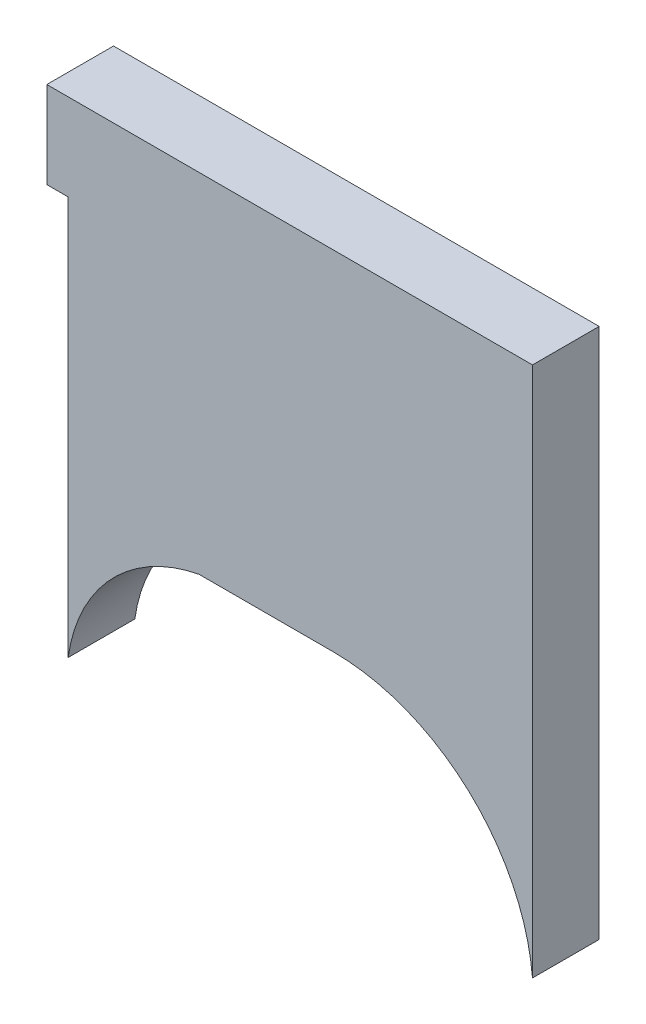
ISO-10303-21;
HEADER;
FILE_DESCRIPTION(('STEP AP214'),'2;1');
FILE_NAME('part.step','',(''),(''),'','','');
FILE_SCHEMA(('AUTOMOTIVE_DESIGN { 1 0 10303 214 1 1 1 1 }'));
ENDSEC;
DATA;
#1=APPLICATION_CONTEXT('core data for automotive mechanical design processes');
#2=APPLICATION_PROTOCOL_DEFINITION('international standard','automotive_design',2000,#1);
#3=PRODUCT_CONTEXT('',#1,'mechanical');
#4=PRODUCT('Part','Part','',(#3));
#5=PRODUCT_RELATED_PRODUCT_CATEGORY('part','',(#4));
#6=PRODUCT_DEFINITION_FORMATION('','',#4);
#7=PRODUCT_DEFINITION_CONTEXT('part definition',#1,'design');
#8=PRODUCT_DEFINITION('design','',#6,#7);
#9=PRODUCT_DEFINITION_SHAPE('','',#8);
#10=(LENGTH_UNIT() NAMED_UNIT(*) SI_UNIT(.MILLI.,.METRE.));
#11=(NAMED_UNIT(*) PLANE_ANGLE_UNIT() SI_UNIT($,.RADIAN.));
#12=(NAMED_UNIT(*) SI_UNIT($,.STERADIAN.) SOLID_ANGLE_UNIT());
#13=UNCERTAINTY_MEASURE_WITH_UNIT(LENGTH_MEASURE(1.E-05),#10,'distance_accuracy_value','');
#14=(GEOMETRIC_REPRESENTATION_CONTEXT(3) GLOBAL_UNCERTAINTY_ASSIGNED_CONTEXT((#13)) GLOBAL_UNIT_ASSIGNED_CONTEXT((#10,
#11,#12)) REPRESENTATION_CONTEXT('',''));
#15=CARTESIAN_POINT('',(0.,0.,0.));
#16=DIRECTION('',(0.,0.,1.));
#17=DIRECTION('',(1.,0.,0.));
#18=AXIS2_PLACEMENT_3D('',#15,#16,#17);
#19=CARTESIAN_POINT('',(30.2935408278828,-18.6876995533296,3.175));
#20=DIRECTION('',(0.,0.,-1.));
#21=DIRECTION('',(-1.,0.,0.));
#22=AXIS2_PLACEMENT_3D('',#19,#20,#21);
#23=CYLINDRICAL_SURFACE('',#22,9.525);
#24=CARTESIAN_POINT('',(30.2935408278828,-18.6876995533296,0.));
#25=DIRECTION('',(0.,0.,-1.));
#26=DIRECTION('',(-1.,0.,0.));
#27=AXIS2_PLACEMENT_3D('',#24,#25,#26);
#28=CIRCLE('',#27,9.525);
#29=CARTESIAN_POINT('',(30.2935408278828,-9.16269955332962,0.));
#30=VERTEX_POINT('',#29);
#31=CARTESIAN_POINT('',(39.7832042011186,-17.8679959101347,0.));
#32=VERTEX_POINT('',#31);
#33=EDGE_CURVE('E130',#30,#32,#28,.T.);
#34=ORIENTED_EDGE('',*,*,#33,.T.);
#35=DIRECTION('',(0.,0.,-1.));
#36=VECTOR('',#35,1.);
#37=CARTESIAN_POINT('',(39.7832042011186,-17.8679959101347,3.175));
#38=LINE('',#37,#36);
#39=CARTESIAN_POINT('',(39.7832042011186,-17.8679959101347,3.175));
#40=VERTEX_POINT('',#39);
#41=EDGE_CURVE('E11',#40,#32,#38,.T.);
#42=ORIENTED_EDGE('',*,*,#41,.F.);
#43=CARTESIAN_POINT('',(30.2935408278828,-18.6876995533296,3.175));
#44=DIRECTION('',(0.,0.,-1.));
#45=DIRECTION('',(-1.,0.,0.));
#46=AXIS2_PLACEMENT_3D('',#43,#44,#45);
#47=CIRCLE('',#46,9.525);
#48=CARTESIAN_POINT('',(30.2935408278828,-9.16269955332962,3.175));
#49=VERTEX_POINT('',#48);
#50=EDGE_CURVE('E146',#49,#40,#47,.T.);
#51=ORIENTED_EDGE('',*,*,#50,.F.);
#52=DIRECTION('',(0.,0.,-1.));
#53=VECTOR('',#52,1.);
#54=CARTESIAN_POINT('',(30.2935408278828,-9.16269955332962,3.175));
#55=LINE('',#54,#53);
#56=EDGE_CURVE('E126',#49,#30,#55,.T.);
#57=ORIENTED_EDGE('',*,*,#56,.T.);
#58=EDGE_LOOP('',(#34,#42,#51,#57));
#59=FACE_BOUND('',#58,.T.);
#60=ADVANCED_FACE('F33',(#59),#23,.F.);
#61=CARTESIAN_POINT('',(39.7832042011186,-6.62269955332962,3.175));
#62=DIRECTION('',(-1.,0.,0.));
#63=DIRECTION('',(0.,0.,1.));
#64=AXIS2_PLACEMENT_3D('',#61,#62,#63);
#65=PLANE('',#64);
#66=DIRECTION('',(0.,1.,0.));
#67=VECTOR('',#66,1.);
#68=CARTESIAN_POINT('',(39.7832042011186,-6.62269955332962,0.));
#69=LINE('',#68,#67);
#70=CARTESIAN_POINT('',(39.7832042011186,7.4068356745039,0.));
#71=VERTEX_POINT('',#70);
#72=EDGE_CURVE('E133',#32,#71,#69,.T.);
#73=ORIENTED_EDGE('',*,*,#72,.T.);
#74=DIRECTION('',(0.,0.,-1.));
#75=VECTOR('',#74,1.);
#76=CARTESIAN_POINT('',(39.7832042011186,7.4068356745039,3.175));
#77=LINE('',#76,#75);
#78=CARTESIAN_POINT('',(39.7832042011186,7.4068356745039,3.175));
#79=VERTEX_POINT('',#78);
#80=EDGE_CURVE('E41',#79,#71,#77,.T.);
#81=ORIENTED_EDGE('',*,*,#80,.F.);
#82=DIRECTION('',(0.,1.,0.));
#83=VECTOR('',#82,1.);
#84=CARTESIAN_POINT('',(39.7832042011186,-17.8679959101347,3.175));
#85=LINE('',#84,#83);
#86=EDGE_CURVE('E90',#40,#79,#85,.T.);
#87=ORIENTED_EDGE('',*,*,#86,.F.);
#88=ORIENTED_EDGE('',*,*,#41,.T.);
#89=EDGE_LOOP('',(#73,#81,#87,#88));
#90=FACE_BOUND('',#89,.T.);
#91=ADVANCED_FACE('F161',(#90),#65,.F.);
#92=CARTESIAN_POINT('',(16.6645695602822,7.4068356745039,3.175));
#93=DIRECTION('',(0.,-1.,0.));
#94=DIRECTION('',(0.,0.,-1.));
#95=AXIS2_PLACEMENT_3D('',#92,#93,#94);
#96=PLANE('',#95);
#97=DIRECTION('',(-1.,0.,0.));
#98=VECTOR('',#97,1.);
#99=CARTESIAN_POINT('',(16.6645695602822,7.4068356745039,0.));
#100=LINE('',#99,#98);
#101=CARTESIAN_POINT('',(16.6645695602822,7.4068356745039,0.));
#102=VERTEX_POINT('',#101);
#103=EDGE_CURVE('E136',#71,#102,#100,.T.);
#104=ORIENTED_EDGE('',*,*,#103,.T.);
#105=DIRECTION('',(0.,0.,-1.));
#106=VECTOR('',#105,1.);
#107=CARTESIAN_POINT('',(16.6645695602822,7.4068356745039,3.175));
#108=LINE('',#107,#106);
#109=CARTESIAN_POINT('',(16.6645695602822,7.4068356745039,3.175));
#110=VERTEX_POINT('',#109);
#111=EDGE_CURVE('E153',#110,#102,#108,.T.);
#112=ORIENTED_EDGE('',*,*,#111,.F.);
#113=DIRECTION('',(-1.,0.,0.));
#114=VECTOR('',#113,1.);
#115=CARTESIAN_POINT('',(39.7832042011186,7.4068356745039,3.175));
#116=LINE('',#115,#114);
#117=EDGE_CURVE('E160',#79,#110,#116,.T.);
#118=ORIENTED_EDGE('',*,*,#117,.F.);
#119=ORIENTED_EDGE('',*,*,#80,.T.);
#120=EDGE_LOOP('',(#104,#112,#118,#119));
#121=FACE_BOUND('',#120,.T.);
#122=ADVANCED_FACE('F158',(#121),#96,.F.);
#123=CARTESIAN_POINT('',(16.6645695602822,3.2793356745039,3.175));
#124=DIRECTION('',(1.,0.,0.));
#125=DIRECTION('',(0.,0.,-1.));
#126=AXIS2_PLACEMENT_3D('',#123,#124,#125);
#127=PLANE('',#126);
#128=DIRECTION('',(0.,-1.,0.));
#129=VECTOR('',#128,1.);
#130=CARTESIAN_POINT('',(16.6645695602822,3.2793356745039,0.));
#131=LINE('',#130,#129);
#132=CARTESIAN_POINT('',(16.6645695602822,3.2793356745039,0.));
#133=VERTEX_POINT('',#132);
#134=EDGE_CURVE('E138',#102,#133,#131,.T.);
#135=ORIENTED_EDGE('',*,*,#134,.T.);
#136=DIRECTION('',(0.,0.,-1.));
#137=VECTOR('',#136,1.);
#138=CARTESIAN_POINT('',(16.6645695602822,3.2793356745039,3.175));
#139=LINE('',#138,#137);
#140=CARTESIAN_POINT('',(16.6645695602822,3.2793356745039,3.175));
#141=VERTEX_POINT('',#140);
#142=EDGE_CURVE('E150',#141,#133,#139,.T.);
#143=ORIENTED_EDGE('',*,*,#142,.F.);
#144=DIRECTION('',(0.,-1.,0.));
#145=VECTOR('',#144,1.);
#146=CARTESIAN_POINT('',(16.6645695602822,3.2793356745039,3.175));
#147=LINE('',#146,#145);
#148=EDGE_CURVE('E172',#110,#141,#147,.T.);
#149=ORIENTED_EDGE('',*,*,#148,.F.);
#150=ORIENTED_EDGE('',*,*,#111,.T.);
#151=EDGE_LOOP('',(#135,#143,#149,#150));
#152=FACE_BOUND('',#151,.T.);
#153=ADVANCED_FACE('F168',(#152),#127,.F.);
#154=CARTESIAN_POINT('',(17.679624466234,3.2793356745039,3.175));
#155=DIRECTION('',(0.,1.,0.));
#156=DIRECTION('',(-1.,0.,0.));
#157=AXIS2_PLACEMENT_3D('',#154,#155,#156);
#158=PLANE('',#157);
#159=DIRECTION('',(1.,0.,0.));
#160=VECTOR('',#159,1.);
#161=CARTESIAN_POINT('',(17.679624466234,3.2793356745039,0.));
#162=LINE('',#161,#160);
#163=CARTESIAN_POINT('',(17.679624466234,3.2793356745039,0.));
#164=VERTEX_POINT('',#163);
#165=EDGE_CURVE('E140',#133,#164,#162,.T.);
#166=ORIENTED_EDGE('',*,*,#165,.T.);
#167=DIRECTION('',(0.,0.,-1.));
#168=VECTOR('',#167,1.);
#169=CARTESIAN_POINT('',(17.679624466234,3.2793356745039,3.175));
#170=LINE('',#169,#168);
#171=CARTESIAN_POINT('',(17.679624466234,3.2793356745039,3.175));
#172=VERTEX_POINT('',#171);
#173=EDGE_CURVE('E121',#172,#164,#170,.T.);
#174=ORIENTED_EDGE('',*,*,#173,.F.);
#175=DIRECTION('',(1.,0.,0.));
#176=VECTOR('',#175,1.);
#177=CARTESIAN_POINT('',(17.679624466234,3.2793356745039,3.175));
#178=LINE('',#177,#176);
#179=EDGE_CURVE('E110',#141,#172,#178,.T.);
#180=ORIENTED_EDGE('',*,*,#179,.F.);
#181=ORIENTED_EDGE('',*,*,#142,.T.);
#182=EDGE_LOOP('',(#166,#174,#180,#181));
#183=FACE_BOUND('',#182,.T.);
#184=ADVANCED_FACE('F171',(#183),#158,.F.);
#185=CARTESIAN_POINT('',(17.679624466234,-15.708018390528,3.175));
#186=DIRECTION('',(1.,0.,0.));
#187=DIRECTION('',(0.,1.,0.));
#188=AXIS2_PLACEMENT_3D('',#185,#186,#187);
#189=PLANE('',#188);
#190=DIRECTION('',(0.,-1.,0.));
#191=VECTOR('',#190,1.);
#192=CARTESIAN_POINT('',(17.679624466234,-15.708018390528,0.));
#193=LINE('',#192,#191);
#194=CARTESIAN_POINT('',(17.679624466234,-15.708018390528,0.));
#195=VERTEX_POINT('',#194);
#196=EDGE_CURVE('E119',#164,#195,#193,.T.);
#197=ORIENTED_EDGE('',*,*,#196,.T.);
#198=DIRECTION('',(0.,0.,-1.));
#199=VECTOR('',#198,1.);
#200=CARTESIAN_POINT('',(17.679624466234,-15.708018390528,3.175));
#201=LINE('',#200,#199);
#202=CARTESIAN_POINT('',(17.679624466234,-15.708018390528,3.175));
#203=VERTEX_POINT('',#202);
#204=EDGE_CURVE('E116',#203,#195,#201,.T.);
#205=ORIENTED_EDGE('',*,*,#204,.F.);
#206=DIRECTION('',(0.,-1.,0.));
#207=VECTOR('',#206,1.);
#208=CARTESIAN_POINT('',(17.679624466234,-15.708018390528,3.175));
#209=LINE('',#208,#207);
#210=EDGE_CURVE('E103',#172,#203,#209,.T.);
#211=ORIENTED_EDGE('',*,*,#210,.F.);
#212=ORIENTED_EDGE('',*,*,#173,.T.);
#213=EDGE_LOOP('',(#197,#205,#211,#212));
#214=FACE_BOUND('',#213,.T.);
#215=ADVANCED_FACE('F117',(#214),#189,.F.);
#216=CARTESIAN_POINT('',(25.3674213613876,-16.7880071503314,3.175));
#217=DIRECTION('',(0.,0.,-1.));
#218=DIRECTION('',(-1.,0.,0.));
#219=AXIS2_PLACEMENT_3D('',#216,#217,#218);
#220=CYLINDRICAL_SURFACE('',#219,7.7632851823461);
#221=CARTESIAN_POINT('',(25.3674213613876,-16.7880071503314,0.));
#222=DIRECTION('',(0.,0.,-1.));
#223=DIRECTION('',(-1.,0.,0.));
#224=AXIS2_PLACEMENT_3D('',#221,#222,#223);
#225=CIRCLE('',#224,7.7632851823461);
#226=CARTESIAN_POINT('',(23.910273162493,-9.16269955332962,0.));
#227=VERTEX_POINT('',#226);
#228=EDGE_CURVE('E143',#195,#227,#225,.T.);
#229=ORIENTED_EDGE('',*,*,#228,.T.);
#230=DIRECTION('',(0.,0.,-1.));
#231=VECTOR('',#230,1.);
#232=CARTESIAN_POINT('',(23.910273162493,-9.16269955332962,3.175));
#233=LINE('',#232,#231);
#234=CARTESIAN_POINT('',(23.910273162493,-9.16269955332962,3.175));
#235=VERTEX_POINT('',#234);
#236=EDGE_CURVE('E122',#235,#227,#233,.T.);
#237=ORIENTED_EDGE('',*,*,#236,.F.);
#238=CARTESIAN_POINT('',(25.3674213613876,-16.7880071503314,3.175));
#239=DIRECTION('',(0.,0.,-1.));
#240=DIRECTION('',(-1.,0.,0.));
#241=AXIS2_PLACEMENT_3D('',#238,#239,#240);
#242=CIRCLE('',#241,7.7632851823461);
#243=EDGE_CURVE('E107',#203,#235,#242,.T.);
#244=ORIENTED_EDGE('',*,*,#243,.F.);
#245=ORIENTED_EDGE('',*,*,#204,.T.);
#246=EDGE_LOOP('',(#229,#237,#244,#245));
#247=FACE_BOUND('',#246,.T.);
#248=ADVANCED_FACE('F124',(#247),#220,.F.);
#249=CARTESIAN_POINT('',(30.2935408278828,-9.16269955332962,3.175));
#250=DIRECTION('',(0.,1.,0.));
#251=DIRECTION('',(0.,0.,1.));
#252=AXIS2_PLACEMENT_3D('',#249,#250,#251);
#253=PLANE('',#252);
#254=DIRECTION('',(1.,0.,0.));
#255=VECTOR('',#254,1.);
#256=CARTESIAN_POINT('',(30.2935408278828,-9.16269955332962,0.));
#257=LINE('',#256,#255);
#258=EDGE_CURVE('E78',#227,#30,#257,.T.);
#259=ORIENTED_EDGE('',*,*,#258,.T.);
#260=ORIENTED_EDGE('',*,*,#56,.F.);
#261=DIRECTION('',(1.,0.,0.));
#262=VECTOR('',#261,1.);
#263=CARTESIAN_POINT('',(23.910273162493,-9.16269955332962,3.175));
#264=LINE('',#263,#262);
#265=EDGE_CURVE('E49',#235,#49,#264,.T.);
#266=ORIENTED_EDGE('',*,*,#265,.F.);
#267=ORIENTED_EDGE('',*,*,#236,.T.);
#268=EDGE_LOOP('',(#259,#260,#266,#267));
#269=FACE_BOUND('',#268,.T.);
#270=ADVANCED_FACE('F179',(#269),#253,.F.);
#271=CARTESIAN_POINT('',(30.2935408278828,-18.6876995533296,3.175));
#272=DIRECTION('',(0.,0.,-1.));
#273=DIRECTION('',(-1.,0.,0.));
#274=AXIS2_PLACEMENT_3D('',#271,#272,#273);
#275=PLANE('',#274);
#276=ORIENTED_EDGE('',*,*,#50,.T.);
#277=ORIENTED_EDGE('',*,*,#86,.T.);
#278=ORIENTED_EDGE('',*,*,#117,.T.);
#279=ORIENTED_EDGE('',*,*,#148,.T.);
#280=ORIENTED_EDGE('',*,*,#179,.T.);
#281=ORIENTED_EDGE('',*,*,#210,.T.);
#282=ORIENTED_EDGE('',*,*,#243,.T.);
#283=ORIENTED_EDGE('',*,*,#265,.T.);
#284=EDGE_LOOP('',(#276,#277,#278,#279,#280,#281,#282,#283));
#285=FACE_BOUND('',#284,.T.);
#286=ADVANCED_FACE('F105',(#285),#275,.F.);
#287=CARTESIAN_POINT('',(30.2935408278828,-18.6876995533296,0.));
#288=DIRECTION('',(0.,0.,-1.));
#289=DIRECTION('',(-1.,0.,0.));
#290=AXIS2_PLACEMENT_3D('',#287,#288,#289);
#291=PLANE('',#290);
#292=ORIENTED_EDGE('',*,*,#33,.F.);
#293=ORIENTED_EDGE('',*,*,#258,.F.);
#294=ORIENTED_EDGE('',*,*,#228,.F.);
#295=ORIENTED_EDGE('',*,*,#196,.F.);
#296=ORIENTED_EDGE('',*,*,#165,.F.);
#297=ORIENTED_EDGE('',*,*,#134,.F.);
#298=ORIENTED_EDGE('',*,*,#103,.F.);
#299=ORIENTED_EDGE('',*,*,#72,.F.);
#300=EDGE_LOOP('',(#292,#293,#294,#295,#296,#297,#298,#299));
#301=FACE_BOUND('',#300,.T.);
#302=ADVANCED_FACE('F163',(#301),#291,.T.);
#303=CLOSED_SHELL('',(#60,#91,#122,#153,#184,#215,#248,#270,#286,#302));
#304=MANIFOLD_SOLID_BREP('B2',#303);
#305=ADVANCED_BREP_SHAPE_REPRESENTATION('',(#18,#304),#14);
#306=SHAPE_DEFINITION_REPRESENTATION(#9,#305);
ENDSEC;
END-ISO-10303-21;
